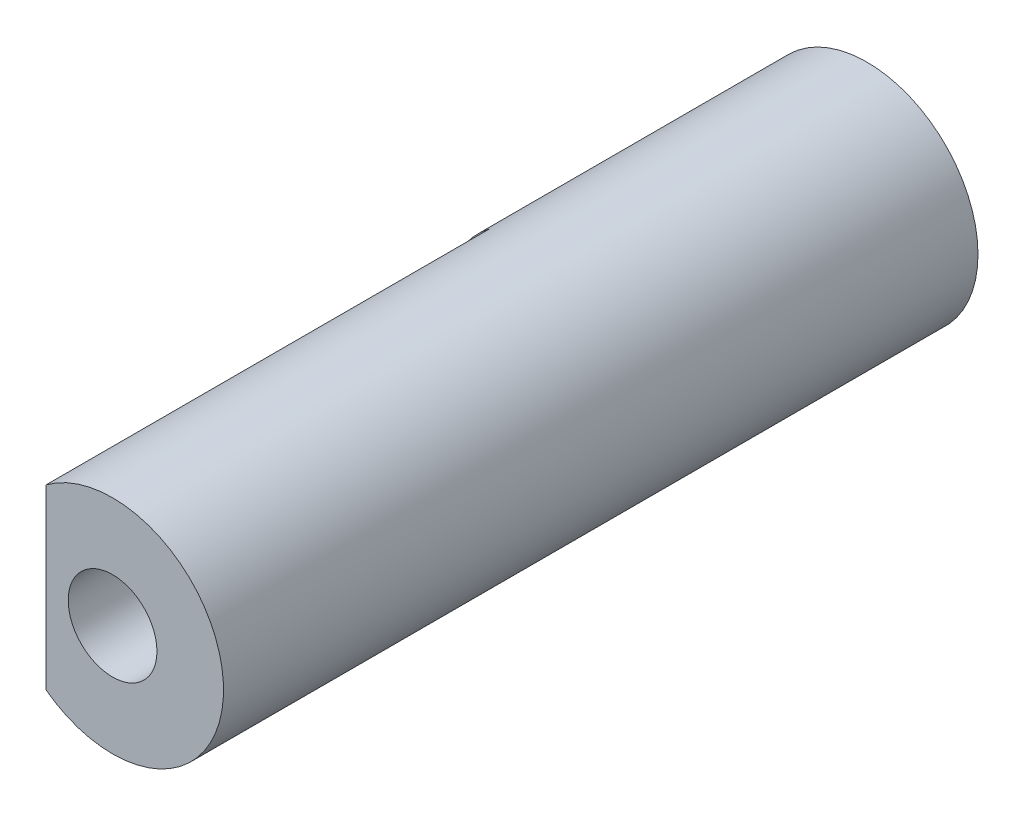
ISO-10303-21;
HEADER;
FILE_DESCRIPTION(('STEP AP214'),'2;1');
FILE_NAME('part.step','',(''),(''),'','','');
FILE_SCHEMA(('AUTOMOTIVE_DESIGN { 1 0 10303 214 1 1 1 1 }'));
ENDSEC;
DATA;
#1=APPLICATION_CONTEXT('core data for automotive mechanical design processes');
#2=APPLICATION_PROTOCOL_DEFINITION('international standard','automotive_design',2000,#1);
#3=PRODUCT_CONTEXT('',#1,'mechanical');
#4=PRODUCT('Part','Part','',(#3));
#5=PRODUCT_RELATED_PRODUCT_CATEGORY('part','',(#4));
#6=PRODUCT_DEFINITION_FORMATION('','',#4);
#7=PRODUCT_DEFINITION_CONTEXT('part definition',#1,'design');
#8=PRODUCT_DEFINITION('design','',#6,#7);
#9=PRODUCT_DEFINITION_SHAPE('','',#8);
#10=(LENGTH_UNIT() NAMED_UNIT(*) SI_UNIT(.MILLI.,.METRE.));
#11=(NAMED_UNIT(*) PLANE_ANGLE_UNIT() SI_UNIT($,.RADIAN.));
#12=(NAMED_UNIT(*) SI_UNIT($,.STERADIAN.) SOLID_ANGLE_UNIT());
#13=UNCERTAINTY_MEASURE_WITH_UNIT(LENGTH_MEASURE(1.E-05),#10,'distance_accuracy_value','');
#14=(GEOMETRIC_REPRESENTATION_CONTEXT(3) GLOBAL_UNCERTAINTY_ASSIGNED_CONTEXT((#13)) GLOBAL_UNIT_ASSIGNED_CONTEXT((#10,
#11,#12)) REPRESENTATION_CONTEXT('',''));
#15=CARTESIAN_POINT('',(0.,0.,0.));
#16=DIRECTION('',(0.,0.,1.));
#17=DIRECTION('',(1.,0.,0.));
#18=AXIS2_PLACEMENT_3D('',#15,#16,#17);
#19=CARTESIAN_POINT('',(0.,0.,17.));
#20=DIRECTION('',(0.,0.,-1.));
#21=DIRECTION('',(-1.,0.,0.));
#22=AXIS2_PLACEMENT_3D('',#19,#20,#21);
#23=CYLINDRICAL_SURFACE('',#22,2.5);
#24=CARTESIAN_POINT('',(0.,0.,17.));
#25=DIRECTION('',(0.,0.,1.));
#26=DIRECTION('',(1.,0.,0.));
#27=AXIS2_PLACEMENT_3D('',#24,#25,#26);
#28=CIRCLE('',#27,2.5);
#29=CARTESIAN_POINT('',(-1.5,-2.,17.));
#30=VERTEX_POINT('',#29);
#31=CARTESIAN_POINT('',(-1.5,2.,17.));
#32=VERTEX_POINT('',#31);
#33=EDGE_CURVE('E75',#30,#32,#28,.T.);
#34=ORIENTED_EDGE('',*,*,#33,.F.);
#35=DIRECTION('',(0.,0.,-1.));
#36=VECTOR('',#35,1.);
#37=CARTESIAN_POINT('',(-1.5,-2.,17.));
#38=LINE('',#37,#36);
#39=CARTESIAN_POINT('',(-1.5,-2.,7.));
#40=VERTEX_POINT('',#39);
#41=EDGE_CURVE('E58',#30,#40,#38,.T.);
#42=ORIENTED_EDGE('',*,*,#41,.T.);
#43=CARTESIAN_POINT('',(0.,0.,7.));
#44=DIRECTION('',(0.,0.,1.));
#45=DIRECTION('',(1.,0.,0.));
#46=AXIS2_PLACEMENT_3D('',#43,#44,#45);
#47=CIRCLE('',#46,2.5);
#48=CARTESIAN_POINT('',(-1.5,2.,7.));
#49=VERTEX_POINT('',#48);
#50=EDGE_CURVE('E11',#49,#40,#47,.T.);
#51=ORIENTED_EDGE('',*,*,#50,.F.);
#52=DIRECTION('',(0.,0.,-1.));
#53=VECTOR('',#52,1.);
#54=CARTESIAN_POINT('',(-1.5,2.,17.));
#55=LINE('',#54,#53);
#56=EDGE_CURVE('E69',#49,#32,#55,.F.);
#57=ORIENTED_EDGE('',*,*,#56,.T.);
#58=EDGE_LOOP('',(#34,#42,#51,#57));
#59=FACE_BOUND('',#58,.T.);
#60=CARTESIAN_POINT('',(0.,0.,0.));
#61=DIRECTION('',(0.,0.,1.));
#62=DIRECTION('',(1.,0.,0.));
#63=AXIS2_PLACEMENT_3D('',#60,#61,#62);
#64=CIRCLE('',#63,2.5);
#65=CARTESIAN_POINT('',(2.5,0.,0.));
#66=VERTEX_POINT('',#65);
#67=EDGE_CURVE('E82',#66,#66,#64,.T.);
#68=ORIENTED_EDGE('',*,*,#67,.T.);
#69=EDGE_LOOP('',(#68));
#70=FACE_BOUND('',#69,.T.);
#71=ADVANCED_FACE('F43',(#59,#70),#23,.T.);
#72=CARTESIAN_POINT('',(0.,0.,17.));
#73=DIRECTION('',(0.,0.,1.));
#74=DIRECTION('',(1.,0.,0.));
#75=AXIS2_PLACEMENT_3D('',#72,#73,#74);
#76=PLANE('',#75);
#77=CARTESIAN_POINT('',(0.,0.,17.));
#78=DIRECTION('',(0.,0.,1.));
#79=DIRECTION('',(1.,0.,0.));
#80=AXIS2_PLACEMENT_3D('',#77,#78,#79);
#81=CIRCLE('',#80,1.);
#82=CARTESIAN_POINT('',(1.,0.,17.));
#83=VERTEX_POINT('',#82);
#84=EDGE_CURVE('E93',#83,#83,#81,.T.);
#85=ORIENTED_EDGE('',*,*,#84,.F.);
#86=EDGE_LOOP('',(#85));
#87=FACE_BOUND('',#86,.T.);
#88=DIRECTION('',(0.,1.,0.));
#89=VECTOR('',#88,1.);
#90=CARTESIAN_POINT('',(-1.5,0.,17.));
#91=LINE('',#90,#89);
#92=EDGE_CURVE('E51',#30,#32,#91,.T.);
#93=ORIENTED_EDGE('',*,*,#92,.F.);
#94=ORIENTED_EDGE('',*,*,#33,.T.);
#95=EDGE_LOOP('',(#93,#94));
#96=FACE_BOUND('',#95,.T.);
#97=ADVANCED_FACE('F80',(#87,#96),#76,.T.);
#98=CARTESIAN_POINT('',(0.,0.,0.));
#99=DIRECTION('',(0.,0.,1.));
#100=DIRECTION('',(1.,0.,0.));
#101=AXIS2_PLACEMENT_3D('',#98,#99,#100);
#102=PLANE('',#101);
#103=ORIENTED_EDGE('',*,*,#67,.F.);
#104=EDGE_LOOP('',(#103));
#105=FACE_BOUND('',#104,.T.);
#106=ADVANCED_FACE('F110',(#105),#102,.F.);
#107=CARTESIAN_POINT('',(0.,0.,7.));
#108=DIRECTION('',(0.,0.,1.));
#109=DIRECTION('',(1.,0.,0.));
#110=AXIS2_PLACEMENT_3D('',#107,#108,#109);
#111=PLANE('',#110);
#112=DIRECTION('',(0.,1.,0.));
#113=VECTOR('',#112,1.);
#114=CARTESIAN_POINT('',(-1.5,2.5,7.));
#115=LINE('',#114,#113);
#116=EDGE_CURVE('E78',#40,#49,#115,.T.);
#117=ORIENTED_EDGE('',*,*,#116,.T.);
#118=ORIENTED_EDGE('',*,*,#50,.T.);
#119=EDGE_LOOP('',(#117,#118));
#120=FACE_BOUND('',#119,.T.);
#121=ADVANCED_FACE('F116',(#120),#111,.T.);
#122=CARTESIAN_POINT('',(-1.5,2.5,7.));
#123=DIRECTION('',(1.,0.,0.));
#124=DIRECTION('',(0.,1.,0.));
#125=AXIS2_PLACEMENT_3D('',#122,#123,#124);
#126=PLANE('',#125);
#127=ORIENTED_EDGE('',*,*,#92,.T.);
#128=ORIENTED_EDGE('',*,*,#56,.F.);
#129=ORIENTED_EDGE('',*,*,#116,.F.);
#130=ORIENTED_EDGE('',*,*,#41,.F.);
#131=EDGE_LOOP('',(#127,#128,#129,#130));
#132=FACE_BOUND('',#131,.T.);
#133=ADVANCED_FACE('F68',(#132),#126,.F.);
#134=CARTESIAN_POINT('',(0.,0.,15.));
#135=DIRECTION('',(0.,0.,1.));
#136=DIRECTION('',(1.,0.,0.));
#137=AXIS2_PLACEMENT_3D('',#134,#135,#136);
#138=CYLINDRICAL_SURFACE('',#137,1.);
#139=CARTESIAN_POINT('',(0.,0.,15.));
#140=DIRECTION('',(0.,0.,1.));
#141=DIRECTION('',(1.,0.,0.));
#142=AXIS2_PLACEMENT_3D('',#139,#140,#141);
#143=CIRCLE('',#142,1.);
#144=CARTESIAN_POINT('',(1.,0.,15.));
#145=VERTEX_POINT('',#144);
#146=EDGE_CURVE('E92',#145,#145,#143,.T.);
#147=ORIENTED_EDGE('',*,*,#146,.F.);
#148=EDGE_LOOP('',(#147));
#149=FACE_BOUND('',#148,.T.);
#150=ORIENTED_EDGE('',*,*,#84,.T.);
#151=EDGE_LOOP('',(#150));
#152=FACE_BOUND('',#151,.T.);
#153=ADVANCED_FACE('F103',(#149,#152),#138,.F.);
#154=CARTESIAN_POINT('',(0.,0.,15.));
#155=DIRECTION('',(0.,0.,1.));
#156=DIRECTION('',(1.,0.,0.));
#157=AXIS2_PLACEMENT_3D('',#154,#155,#156);
#158=PLANE('',#157);
#159=ORIENTED_EDGE('',*,*,#146,.T.);
#160=EDGE_LOOP('',(#159));
#161=FACE_BOUND('',#160,.T.);
#162=ADVANCED_FACE('F101',(#161),#158,.T.);
#163=CLOSED_SHELL('',(#71,#97,#106,#121,#133,#153,#162));
#164=MANIFOLD_SOLID_BREP('B2',#163);
#165=ADVANCED_BREP_SHAPE_REPRESENTATION('',(#18,#164),#14);
#166=SHAPE_DEFINITION_REPRESENTATION(#9,#165);
ENDSEC;
END-ISO-10303-21;
